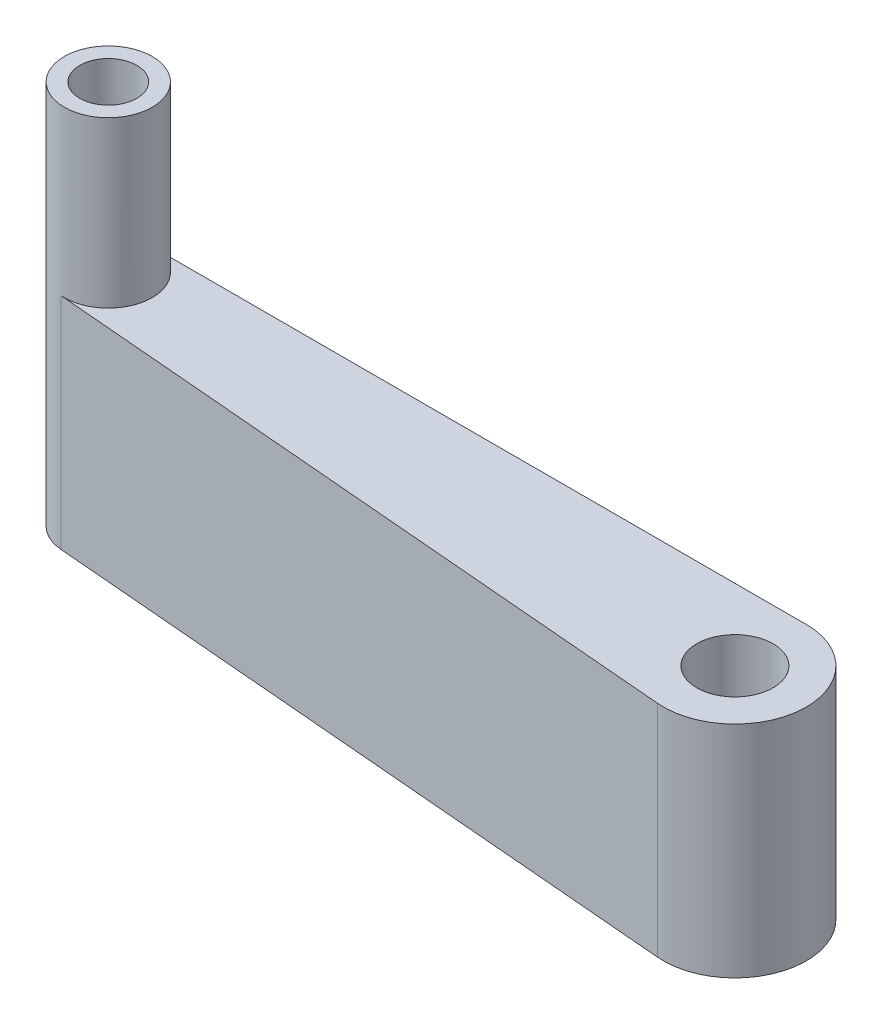
ISO-10303-21;
HEADER;
FILE_DESCRIPTION(('STEP AP214'),'2;1');
FILE_NAME('part.step','',(''),(''),'','','');
FILE_SCHEMA(('AUTOMOTIVE_DESIGN { 1 0 10303 214 1 1 1 1 }'));
ENDSEC;
DATA;
#1=APPLICATION_CONTEXT('core data for automotive mechanical design processes');
#2=APPLICATION_PROTOCOL_DEFINITION('international standard','automotive_design',2000,#1);
#3=PRODUCT_CONTEXT('',#1,'mechanical');
#4=PRODUCT('Part','Part','',(#3));
#5=PRODUCT_RELATED_PRODUCT_CATEGORY('part','',(#4));
#6=PRODUCT_DEFINITION_FORMATION('','',#4);
#7=PRODUCT_DEFINITION_CONTEXT('part definition',#1,'design');
#8=PRODUCT_DEFINITION('design','',#6,#7);
#9=PRODUCT_DEFINITION_SHAPE('','',#8);
#10=(LENGTH_UNIT() NAMED_UNIT(*) SI_UNIT(.MILLI.,.METRE.));
#11=(NAMED_UNIT(*) PLANE_ANGLE_UNIT() SI_UNIT($,.RADIAN.));
#12=(NAMED_UNIT(*) SI_UNIT($,.STERADIAN.) SOLID_ANGLE_UNIT());
#13=UNCERTAINTY_MEASURE_WITH_UNIT(LENGTH_MEASURE(1.E-05),#10,'distance_accuracy_value','');
#14=(GEOMETRIC_REPRESENTATION_CONTEXT(3) GLOBAL_UNCERTAINTY_ASSIGNED_CONTEXT((#13)) GLOBAL_UNIT_ASSIGNED_CONTEXT((#10,
#11,#12)) REPRESENTATION_CONTEXT('',''));
#15=CARTESIAN_POINT('',(0.,0.,0.));
#16=DIRECTION('',(0.,0.,1.));
#17=DIRECTION('',(1.,0.,0.));
#18=AXIS2_PLACEMENT_3D('',#15,#16,#17);
#19=CARTESIAN_POINT('',(0.,10.,0.));
#20=DIRECTION('',(0.,-1.,0.));
#21=DIRECTION('',(0.,0.,-1.));
#22=AXIS2_PLACEMENT_3D('',#19,#20,#21);
#23=CYLINDRICAL_SURFACE('',#22,6.5);
#24=CARTESIAN_POINT('',(0.,-10.,0.));
#25=DIRECTION('',(0.,1.,0.));
#26=DIRECTION('',(0.,0.,1.));
#27=AXIS2_PLACEMENT_3D('',#24,#25,#26);
#28=CIRCLE('',#27,6.5);
#29=CARTESIAN_POINT('',(-0.545255886084874,-10.,6.47709008881996));
#30=VERTEX_POINT('',#29);
#31=CARTESIAN_POINT('',(0.,-10.,-6.5));
#32=VERTEX_POINT('',#31);
#33=EDGE_CURVE('E101',#30,#32,#28,.T.);
#34=ORIENTED_EDGE('',*,*,#33,.T.);
#35=DIRECTION('',(0.,-1.,0.));
#36=VECTOR('',#35,1.);
#37=CARTESIAN_POINT('',(0.,10.,-6.5));
#38=LINE('',#37,#36);
#39=CARTESIAN_POINT('',(0.,10.,-6.5));
#40=VERTEX_POINT('',#39);
#41=EDGE_CURVE('E36',#40,#32,#38,.T.);
#42=ORIENTED_EDGE('',*,*,#41,.F.);
#43=CARTESIAN_POINT('',(0.,10.,0.));
#44=DIRECTION('',(0.,1.,0.));
#45=DIRECTION('',(0.,0.,1.));
#46=AXIS2_PLACEMENT_3D('',#43,#44,#45);
#47=CIRCLE('',#46,6.5);
#48=CARTESIAN_POINT('',(-0.545255886084874,10.,6.47709008881996));
#49=VERTEX_POINT('',#48);
#50=EDGE_CURVE('E89',#49,#40,#47,.T.);
#51=ORIENTED_EDGE('',*,*,#50,.F.);
#52=DIRECTION('',(0.,-1.,0.));
#53=VECTOR('',#52,1.);
#54=CARTESIAN_POINT('',(-0.545255886084874,10.,6.47709008881996));
#55=LINE('',#54,#53);
#56=EDGE_CURVE('E94',#49,#30,#55,.T.);
#57=ORIENTED_EDGE('',*,*,#56,.T.);
#58=EDGE_LOOP('',(#34,#42,#51,#57));
#59=FACE_BOUND('',#58,.T.);
#60=ADVANCED_FACE('F33',(#59),#23,.T.);
#61=CARTESIAN_POINT('',(-59.5,10.,-6.5));
#62=DIRECTION('',(0.,0.,1.));
#63=DIRECTION('',(1.,0.,0.));
#64=AXIS2_PLACEMENT_3D('',#61,#62,#63);
#65=PLANE('',#64);
#66=DIRECTION('',(-1.,0.,0.));
#67=VECTOR('',#66,1.);
#68=CARTESIAN_POINT('',(-59.5,-10.,-6.5));
#69=LINE('',#68,#67);
#70=CARTESIAN_POINT('',(-59.5,-10.,-6.5));
#71=VERTEX_POINT('',#70);
#72=EDGE_CURVE('E84',#32,#71,#69,.T.);
#73=ORIENTED_EDGE('',*,*,#72,.T.);
#74=DIRECTION('',(0.,-1.,0.));
#75=VECTOR('',#74,1.);
#76=CARTESIAN_POINT('',(-59.5,10.,-6.5));
#77=LINE('',#76,#75);
#78=CARTESIAN_POINT('',(-59.5,10.,-6.50000000000001));
#79=VERTEX_POINT('',#78);
#80=EDGE_CURVE('E82',#79,#71,#77,.T.);
#81=ORIENTED_EDGE('',*,*,#80,.F.);
#82=DIRECTION('',(-1.,0.,0.));
#83=VECTOR('',#82,1.);
#84=CARTESIAN_POINT('',(-59.5,10.,-6.5));
#85=LINE('',#84,#83);
#86=EDGE_CURVE('E80',#40,#79,#85,.T.);
#87=ORIENTED_EDGE('',*,*,#86,.F.);
#88=ORIENTED_EDGE('',*,*,#41,.T.);
#89=EDGE_LOOP('',(#73,#81,#87,#88));
#90=FACE_BOUND('',#89,.T.);
#91=ADVANCED_FACE('F83',(#90),#65,.F.);
#92=CARTESIAN_POINT('',(-59.5,10.,-2.5));
#93=DIRECTION('',(0.,-1.,0.));
#94=DIRECTION('',(0.,0.,-1.));
#95=AXIS2_PLACEMENT_3D('',#92,#93,#94);
#96=CYLINDRICAL_SURFACE('',#95,4.);
#97=CARTESIAN_POINT('',(-59.5,-10.,-2.5));
#98=DIRECTION('',(0.,1.,0.));
#99=DIRECTION('',(0.,0.,1.));
#100=AXIS2_PLACEMENT_3D('',#97,#98,#99);
#101=CIRCLE('',#100,4.);
#102=CARTESIAN_POINT('',(-59.8355420837445,-10.,1.48590159311998));
#103=VERTEX_POINT('',#102);
#104=EDGE_CURVE('E68',#71,#103,#101,.T.);
#105=ORIENTED_EDGE('',*,*,#104,.T.);
#106=DIRECTION('',(0.,-1.,0.));
#107=VECTOR('',#106,1.);
#108=CARTESIAN_POINT('',(-59.8355420837445,10.,1.48590159311998));
#109=LINE('',#108,#107);
#110=CARTESIAN_POINT('',(-59.8355420837445,10.,1.48590159311998));
#111=VERTEX_POINT('',#110);
#112=EDGE_CURVE('E85',#111,#103,#109,.T.);
#113=ORIENTED_EDGE('',*,*,#112,.F.);
#114=CARTESIAN_POINT('',(-59.5,10.,-2.5));
#115=DIRECTION('',(0.,1.,0.));
#116=DIRECTION('',(0.,0.,1.));
#117=AXIS2_PLACEMENT_3D('',#114,#115,#116);
#118=CIRCLE('',#117,4.00000000000001);
#119=EDGE_CURVE('E11',#111,#79,#118,.T.);
#120=ORIENTED_EDGE('',*,*,#119,.T.);
#121=ORIENTED_EDGE('',*,*,#80,.T.);
#122=EDGE_LOOP('',(#105,#113,#120,#121));
#123=FACE_BOUND('',#122,.T.);
#124=CARTESIAN_POINT('',(-59.5,25.,-2.5));
#125=DIRECTION('',(0.,1.,0.));
#126=DIRECTION('',(0.,0.,1.));
#127=AXIS2_PLACEMENT_3D('',#124,#125,#126);
#128=CIRCLE('',#127,4.00000000000001);
#129=CARTESIAN_POINT('',(-59.5,25.,1.50000000000001));
#130=VERTEX_POINT('',#129);
#131=EDGE_CURVE('E111',#130,#130,#128,.T.);
#132=ORIENTED_EDGE('',*,*,#131,.F.);
#133=EDGE_LOOP('',(#132));
#134=FACE_BOUND('',#133,.T.);
#135=ADVANCED_FACE('F92',(#123,#134),#96,.T.);
#136=CARTESIAN_POINT('',(-59.8355420837445,10.,1.48590159311998));
#137=DIRECTION('',(0.0838855209361342,0.,-0.996475398279994));
#138=DIRECTION('',(-0.996475398279994,0.,-0.0838855209361342));
#139=AXIS2_PLACEMENT_3D('',#136,#137,#138);
#140=PLANE('',#139);
#141=DIRECTION('',(0.996475398279995,0.,0.0838855209361342));
#142=VECTOR('',#141,1.);
#143=CARTESIAN_POINT('',(-59.8355420837445,-10.,1.48590159311998));
#144=LINE('',#143,#142);
#145=EDGE_CURVE('E73',#103,#30,#144,.T.);
#146=ORIENTED_EDGE('',*,*,#145,.T.);
#147=ORIENTED_EDGE('',*,*,#56,.F.);
#148=DIRECTION('',(0.996475398279995,0.,0.0838855209361342));
#149=VECTOR('',#148,1.);
#150=CARTESIAN_POINT('',(-59.8355420837445,10.,1.48590159311998));
#151=LINE('',#150,#149);
#152=EDGE_CURVE('E50',#111,#49,#151,.T.);
#153=ORIENTED_EDGE('',*,*,#152,.F.);
#154=ORIENTED_EDGE('',*,*,#112,.T.);
#155=EDGE_LOOP('',(#146,#147,#153,#154));
#156=FACE_BOUND('',#155,.T.);
#157=ADVANCED_FACE('F96',(#156),#140,.F.);
#158=CARTESIAN_POINT('',(0.,10.,0.));
#159=DIRECTION('',(0.,1.,0.));
#160=DIRECTION('',(0.,0.,1.));
#161=AXIS2_PLACEMENT_3D('',#158,#159,#160);
#162=PLANE('',#161);
#163=ORIENTED_EDGE('',*,*,#119,.F.);
#164=ORIENTED_EDGE('',*,*,#152,.T.);
#165=ORIENTED_EDGE('',*,*,#50,.T.);
#166=ORIENTED_EDGE('',*,*,#86,.T.);
#167=EDGE_LOOP('',(#163,#164,#165,#166));
#168=FACE_BOUND('',#167,.T.);
#169=CARTESIAN_POINT('',(0.,10.,0.));
#170=DIRECTION('',(0.,1.,0.));
#171=DIRECTION('',(0.,0.,1.));
#172=AXIS2_PLACEMENT_3D('',#169,#170,#171);
#173=CIRCLE('',#172,3.475);
#174=CARTESIAN_POINT('',(0.,10.,3.475));
#175=VERTEX_POINT('',#174);
#176=EDGE_CURVE('E108',#175,#175,#173,.T.);
#177=ORIENTED_EDGE('',*,*,#176,.F.);
#178=EDGE_LOOP('',(#177));
#179=FACE_BOUND('',#178,.T.);
#180=ADVANCED_FACE('F86',(#168,#179),#162,.T.);
#181=CARTESIAN_POINT('',(0.,-10.,0.));
#182=DIRECTION('',(0.,1.,0.));
#183=DIRECTION('',(0.,0.,1.));
#184=AXIS2_PLACEMENT_3D('',#181,#182,#183);
#185=PLANE('',#184);
#186=CARTESIAN_POINT('',(0.,-10.,0.));
#187=DIRECTION('',(0.,1.,0.));
#188=DIRECTION('',(0.,0.,1.));
#189=AXIS2_PLACEMENT_3D('',#186,#187,#188);
#190=CIRCLE('',#189,3.475);
#191=CARTESIAN_POINT('',(0.,-10.,3.475));
#192=VERTEX_POINT('',#191);
#193=EDGE_CURVE('E104',#192,#192,#190,.T.);
#194=ORIENTED_EDGE('',*,*,#193,.T.);
#195=EDGE_LOOP('',(#194));
#196=FACE_BOUND('',#195,.T.);
#197=ORIENTED_EDGE('',*,*,#33,.F.);
#198=ORIENTED_EDGE('',*,*,#145,.F.);
#199=ORIENTED_EDGE('',*,*,#104,.F.);
#200=ORIENTED_EDGE('',*,*,#72,.F.);
#201=EDGE_LOOP('',(#197,#198,#199,#200));
#202=FACE_BOUND('',#201,.T.);
#203=ADVANCED_FACE('F150',(#196,#202),#185,.F.);
#204=CARTESIAN_POINT('',(0.,-10.,0.));
#205=DIRECTION('',(0.,1.,0.));
#206=DIRECTION('',(0.,0.,1.));
#207=AXIS2_PLACEMENT_3D('',#204,#205,#206);
#208=CYLINDRICAL_SURFACE('',#207,3.475);
#209=ORIENTED_EDGE('',*,*,#193,.F.);
#210=EDGE_LOOP('',(#209));
#211=FACE_BOUND('',#210,.T.);
#212=ORIENTED_EDGE('',*,*,#176,.T.);
#213=EDGE_LOOP('',(#212));
#214=FACE_BOUND('',#213,.T.);
#215=ADVANCED_FACE('F134',(#211,#214),#208,.F.);
#216=CARTESIAN_POINT('',(-59.5,25.,-2.5));
#217=DIRECTION('',(0.,1.,0.));
#218=DIRECTION('',(0.,0.,1.));
#219=AXIS2_PLACEMENT_3D('',#216,#217,#218);
#220=PLANE('',#219);
#221=CARTESIAN_POINT('',(-59.5,25.,-2.5));
#222=DIRECTION('',(0.,1.,0.));
#223=DIRECTION('',(0.,0.,1.));
#224=AXIS2_PLACEMENT_3D('',#221,#222,#223);
#225=CIRCLE('',#224,2.6);
#226=CARTESIAN_POINT('',(-59.5,25.,0.0999999999999977));
#227=VERTEX_POINT('',#226);
#228=EDGE_CURVE('E117',#227,#227,#225,.T.);
#229=ORIENTED_EDGE('',*,*,#228,.F.);
#230=EDGE_LOOP('',(#229));
#231=FACE_BOUND('',#230,.T.);
#232=ORIENTED_EDGE('',*,*,#131,.T.);
#233=EDGE_LOOP('',(#232));
#234=FACE_BOUND('',#233,.T.);
#235=ADVANCED_FACE('F128',(#231,#234),#220,.T.);
#236=CARTESIAN_POINT('',(-59.5,19.,-2.5));
#237=DIRECTION('',(0.,1.,0.));
#238=DIRECTION('',(0.,0.,1.));
#239=AXIS2_PLACEMENT_3D('',#236,#237,#238);
#240=CYLINDRICAL_SURFACE('',#239,2.6);
#241=CARTESIAN_POINT('',(-59.5,19.,-2.5));
#242=DIRECTION('',(0.,1.,0.));
#243=DIRECTION('',(0.,0.,1.));
#244=AXIS2_PLACEMENT_3D('',#241,#242,#243);
#245=CIRCLE('',#244,2.6);
#246=CARTESIAN_POINT('',(-59.5,19.,0.0999999999999977));
#247=VERTEX_POINT('',#246);
#248=EDGE_CURVE('E116',#247,#247,#245,.T.);
#249=ORIENTED_EDGE('',*,*,#248,.F.);
#250=EDGE_LOOP('',(#249));
#251=FACE_BOUND('',#250,.T.);
#252=ORIENTED_EDGE('',*,*,#228,.T.);
#253=EDGE_LOOP('',(#252));
#254=FACE_BOUND('',#253,.T.);
#255=ADVANCED_FACE('F125',(#251,#254),#240,.F.);
#256=CARTESIAN_POINT('',(-59.5,19.,-2.5));
#257=DIRECTION('',(0.,1.,0.));
#258=DIRECTION('',(0.,0.,1.));
#259=AXIS2_PLACEMENT_3D('',#256,#257,#258);
#260=PLANE('',#259);
#261=ORIENTED_EDGE('',*,*,#248,.T.);
#262=EDGE_LOOP('',(#261));
#263=FACE_BOUND('',#262,.T.);
#264=ADVANCED_FACE('F123',(#263),#260,.T.);
#265=CLOSED_SHELL('',(#60,#91,#135,#157,#180,#203,#215,#235,#255,#264));
#266=MANIFOLD_SOLID_BREP('B2',#265);
#267=ADVANCED_BREP_SHAPE_REPRESENTATION('',(#18,#266),#14);
#268=SHAPE_DEFINITION_REPRESENTATION(#9,#267);
ENDSEC;
END-ISO-10303-21;
